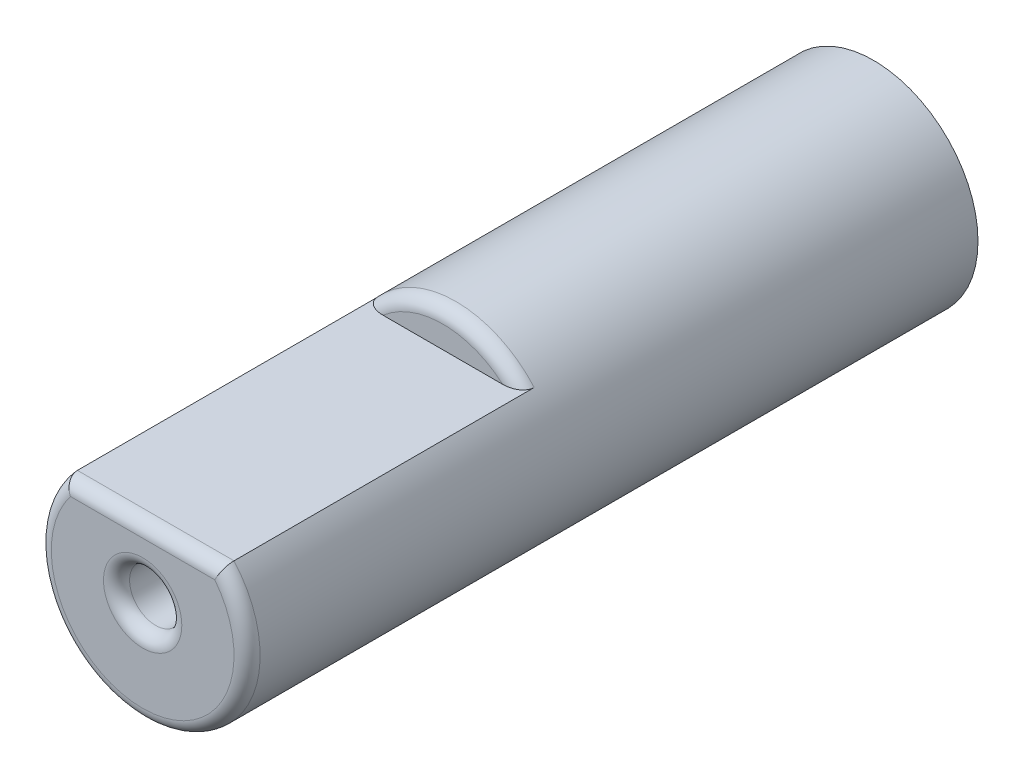
ISO-10303-21;
HEADER;
FILE_DESCRIPTION(('STEP AP214'),'2;1');
FILE_NAME('part.step','',(''),(''),'','','');
FILE_SCHEMA(('AUTOMOTIVE_DESIGN { 1 0 10303 214 1 1 1 1 }'));
ENDSEC;
DATA;
#1=APPLICATION_CONTEXT('core data for automotive mechanical design processes');
#2=APPLICATION_PROTOCOL_DEFINITION('international standard','automotive_design',2000,#1);
#3=PRODUCT_CONTEXT('',#1,'mechanical');
#4=PRODUCT('Part','Part','',(#3));
#5=PRODUCT_RELATED_PRODUCT_CATEGORY('part','',(#4));
#6=PRODUCT_DEFINITION_FORMATION('','',#4);
#7=PRODUCT_DEFINITION_CONTEXT('part definition',#1,'design');
#8=PRODUCT_DEFINITION('design','',#6,#7);
#9=PRODUCT_DEFINITION_SHAPE('','',#8);
#10=(LENGTH_UNIT() NAMED_UNIT(*) SI_UNIT(.MILLI.,.METRE.));
#11=(NAMED_UNIT(*) PLANE_ANGLE_UNIT() SI_UNIT($,.RADIAN.));
#12=(NAMED_UNIT(*) SI_UNIT($,.STERADIAN.) SOLID_ANGLE_UNIT());
#13=UNCERTAINTY_MEASURE_WITH_UNIT(LENGTH_MEASURE(1.E-05),#10,'distance_accuracy_value','');
#14=(GEOMETRIC_REPRESENTATION_CONTEXT(3) GLOBAL_UNCERTAINTY_ASSIGNED_CONTEXT((#13)) GLOBAL_UNIT_ASSIGNED_CONTEXT((#10,
#11,#12)) REPRESENTATION_CONTEXT('',''));
#15=CARTESIAN_POINT('',(0.,0.,0.));
#16=DIRECTION('',(0.,0.,1.));
#17=DIRECTION('',(1.,0.,0.));
#18=AXIS2_PLACEMENT_3D('',#15,#16,#17);
#19=CARTESIAN_POINT('',(0.,0.,28.));
#20=DIRECTION('',(0.,0.,-1.));
#21=DIRECTION('',(-1.,0.,0.));
#22=AXIS2_PLACEMENT_3D('',#19,#20,#21);
#23=CYLINDRICAL_SURFACE('',#22,4.);
#24=DIRECTION('',(0.,0.,1.));
#25=VECTOR('',#24,1.);
#26=CARTESIAN_POINT('',(-3.,2.64575131106459,16.5));
#27=LINE('',#26,#25);
#28=CARTESIAN_POINT('',(-3.,2.64575131106459,16.));
#29=VERTEX_POINT('',#28);
#30=CARTESIAN_POINT('',(-3.,2.64575131106459,27.5));
#31=VERTEX_POINT('',#30);
#32=EDGE_CURVE('E101',#29,#31,#27,.T.);
#33=ORIENTED_EDGE('',*,*,#32,.F.);
#34=CARTESIAN_POINT('',(0.,0.,16.));
#35=DIRECTION('',(0.,0.,1.));
#36=DIRECTION('',(1.,0.,0.));
#37=AXIS2_PLACEMENT_3D('',#34,#35,#36);
#38=CIRCLE('',#37,4.);
#39=CARTESIAN_POINT('',(3.,2.64575131106459,16.));
#40=VERTEX_POINT('',#39);
#41=EDGE_CURVE('E87',#29,#40,#38,.F.);
#42=ORIENTED_EDGE('',*,*,#41,.T.);
#43=DIRECTION('',(0.,0.,1.));
#44=VECTOR('',#43,1.);
#45=CARTESIAN_POINT('',(3.,2.64575131106459,16.5));
#46=LINE('',#45,#44);
#47=CARTESIAN_POINT('',(3.,2.64575131106459,27.5));
#48=VERTEX_POINT('',#47);
#49=EDGE_CURVE('E104',#40,#48,#46,.T.);
#50=ORIENTED_EDGE('',*,*,#49,.T.);
#51=CARTESIAN_POINT('',(0.,0.,27.5));
#52=DIRECTION('',(0.,0.,1.));
#53=DIRECTION('',(1.,0.,0.));
#54=AXIS2_PLACEMENT_3D('',#51,#52,#53);
#55=CIRCLE('',#54,4.);
#56=EDGE_CURVE('E97',#48,#31,#55,.F.);
#57=ORIENTED_EDGE('',*,*,#56,.T.);
#58=EDGE_LOOP('',(#33,#42,#50,#57));
#59=FACE_BOUND('',#58,.T.);
#60=CARTESIAN_POINT('',(0.,0.,0.));
#61=DIRECTION('',(0.,0.,1.));
#62=DIRECTION('',(1.,0.,0.));
#63=AXIS2_PLACEMENT_3D('',#60,#61,#62);
#64=CIRCLE('',#63,4.);
#65=CARTESIAN_POINT('',(4.,0.,0.));
#66=VERTEX_POINT('',#65);
#67=EDGE_CURVE('E98',#66,#66,#64,.T.);
#68=ORIENTED_EDGE('',*,*,#67,.T.);
#69=EDGE_LOOP('',(#68));
#70=FACE_BOUND('',#69,.T.);
#71=ADVANCED_FACE('F34',(#59,#70),#23,.T.);
#72=CARTESIAN_POINT('',(0.,0.,28.));
#73=DIRECTION('',(0.,0.,1.));
#74=DIRECTION('',(1.,0.,0.));
#75=AXIS2_PLACEMENT_3D('',#72,#73,#74);
#76=PLANE('',#75);
#77=CARTESIAN_POINT('',(0.,0.,28.));
#78=DIRECTION('',(0.,0.,1.));
#79=DIRECTION('',(1.,0.,0.));
#80=AXIS2_PLACEMENT_3D('',#77,#78,#79);
#81=CIRCLE('',#80,3.5);
#82=CARTESIAN_POINT('',(-2.76509517215314,2.14575131106459,28.));
#83=VERTEX_POINT('',#82);
#84=CARTESIAN_POINT('',(2.76509517215314,2.14575131106459,28.));
#85=VERTEX_POINT('',#84);
#86=EDGE_CURVE('E55',#83,#85,#81,.T.);
#87=ORIENTED_EDGE('',*,*,#86,.T.);
#88=DIRECTION('',(1.,0.,0.));
#89=VECTOR('',#88,1.);
#90=CARTESIAN_POINT('',(-3.,2.14575131106459,28.));
#91=LINE('',#90,#89);
#92=EDGE_CURVE('E122',#85,#83,#91,.F.);
#93=ORIENTED_EDGE('',*,*,#92,.T.);
#94=EDGE_LOOP('',(#87,#93));
#95=FACE_BOUND('',#94,.T.);
#96=CARTESIAN_POINT('',(0.,0.,28.));
#97=DIRECTION('',(0.,0.,1.));
#98=DIRECTION('',(1.,0.,0.));
#99=AXIS2_PLACEMENT_3D('',#96,#97,#98);
#100=CIRCLE('',#99,1.5);
#101=CARTESIAN_POINT('',(1.5,0.,28.));
#102=VERTEX_POINT('',#101);
#103=EDGE_CURVE('E118',#102,#102,#100,.F.);
#104=ORIENTED_EDGE('',*,*,#103,.T.);
#105=EDGE_LOOP('',(#104));
#106=FACE_BOUND('',#105,.T.);
#107=ADVANCED_FACE('F161',(#95,#106),#76,.T.);
#108=CARTESIAN_POINT('',(0.,0.,0.));
#109=DIRECTION('',(0.,0.,1.));
#110=DIRECTION('',(1.,0.,0.));
#111=AXIS2_PLACEMENT_3D('',#108,#109,#110);
#112=PLANE('',#111);
#113=ORIENTED_EDGE('',*,*,#67,.F.);
#114=EDGE_LOOP('',(#113));
#115=FACE_BOUND('',#114,.T.);
#116=ADVANCED_FACE('F164',(#115),#112,.F.);
#117=CARTESIAN_POINT('',(0.,2.64575131106459,16.5));
#118=DIRECTION('',(0.,-1.,0.));
#119=DIRECTION('',(0.,0.,-1.));
#120=AXIS2_PLACEMENT_3D('',#117,#118,#119);
#121=PLANE('',#120);
#122=ORIENTED_EDGE('',*,*,#32,.T.);
#123=DIRECTION('',(1.,0.,0.));
#124=VECTOR('',#123,1.);
#125=CARTESIAN_POINT('',(3.,2.64575131106459,27.5));
#126=LINE('',#125,#124);
#127=EDGE_CURVE('E115',#31,#48,#126,.T.);
#128=ORIENTED_EDGE('',*,*,#127,.T.);
#129=ORIENTED_EDGE('',*,*,#49,.F.);
#130=CARTESIAN_POINT('',(3.,2.64575131106459,16.));
#131=CARTESIAN_POINT('',(3.00004568685277,2.64575131106459,16.0230193453264));
#132=CARTESIAN_POINT('',(2.99788383820409,2.64575131106459,16.0459961822174));
#133=CARTESIAN_POINT('',(2.98953041582165,2.64575131106459,16.0910479125308));
#134=CARTESIAN_POINT('',(2.98336675862011,2.64575131106459,16.113127936661));
#135=CARTESIAN_POINT('',(2.96740048878864,2.64575131106459,16.1558654444842));
#136=CARTESIAN_POINT('',(2.95760462623021,2.64575131106459,16.1765254831761));
#137=CARTESIAN_POINT('',(2.93490880456858,2.64575131106459,16.2160865364314));
#138=CARTESIAN_POINT('',(2.9220034258787,2.64575131106459,16.2349843990397));
#139=CARTESIAN_POINT('',(2.8890042639193,2.64575131106459,16.2766174559083));
#140=CARTESIAN_POINT('',(2.86794029393532,2.64575131106459,16.2985835896836));
#141=CARTESIAN_POINT('',(2.82253698699825,2.64575131106459,16.3387894061792));
#142=CARTESIAN_POINT('',(2.79819349958651,2.64575131106459,16.357024291859));
#143=CARTESIAN_POINT('',(2.73809689337387,2.64575131106459,16.3957306430875));
#144=CARTESIAN_POINT('',(2.70136920553672,2.64575131106459,16.4146835736586));
#145=CARTESIAN_POINT('',(2.62531330839122,2.64575131106459,16.446536686204));
#146=CARTESIAN_POINT('',(2.58597660154015,2.64575131106459,16.4594158583343));
#147=CARTESIAN_POINT('',(2.50421549540069,2.64575131106459,16.4801588282907));
#148=CARTESIAN_POINT('',(2.46173124773031,2.64575131106459,16.4877795178172));
#149=CARTESIAN_POINT('',(2.3765579949658,2.64575131106459,16.4976629432807));
#150=CARTESIAN_POINT('',(2.3338752229978,2.64575131106459,16.4999781855193));
#151=CARTESIAN_POINT('',(2.29128784747792,2.64575131106459,16.5));
#152=B_SPLINE_CURVE_WITH_KNOTS('',3,(#130,#131,#132,#133,#134,#135,#136,#137,#138,#139,#140,
#141,#142,#143,#144,#145,#146,#147,#148,#149,#150,#151),.UNSPECIFIED.,.F.,.F.,(4,2,2,2,2,2,2,2,
2,2,4),(0.,0.0688894038574242,0.137303326526233,0.205590741191153,0.273998046289219,
0.364799712254438,0.455717392959363,0.579033398001607,0.702772894254838,0.831906529224117,
0.959756546239205),.UNSPECIFIED.);
#153=CARTESIAN_POINT('',(2.29128784747792,2.64575131106459,16.5));
#154=VERTEX_POINT('',#153);
#155=EDGE_CURVE('E11',#40,#154,#152,.T.);
#156=ORIENTED_EDGE('',*,*,#155,.T.);
#157=DIRECTION('',(1.,0.,0.));
#158=VECTOR('',#157,1.);
#159=CARTESIAN_POINT('',(0.,2.64575131106459,16.5));
#160=LINE('',#159,#158);
#161=CARTESIAN_POINT('',(-2.29128784747792,2.64575131106459,16.5));
#162=VERTEX_POINT('',#161);
#163=EDGE_CURVE('E96',#162,#154,#160,.T.);
#164=ORIENTED_EDGE('',*,*,#163,.F.);
#165=CARTESIAN_POINT('',(-2.29128784747792,2.64575131106459,16.5));
#166=CARTESIAN_POINT('',(-2.32027542926785,2.64575131106459,16.499990906309));
#167=CARTESIAN_POINT('',(-2.34924685102549,2.64575131106459,16.4989185116753));
#168=CARTESIAN_POINT('',(-2.40709304909515,2.64575131106459,16.4944506968548));
#169=CARTESIAN_POINT('',(-2.43596729022,2.64575131106459,16.4910484507582));
#170=CARTESIAN_POINT('',(-2.5226833070158,2.64575131106459,16.4769628626549));
#171=CARTESIAN_POINT('',(-2.5800112582815,2.64575131106459,16.462392274396));
#172=CARTESIAN_POINT('',(-2.6676711180261,2.64575131106459,16.4296146392619));
#173=CARTESIAN_POINT('',(-2.69948326943526,2.64575131106459,16.4153097569751));
#174=CARTESIAN_POINT('',(-2.76053619618049,2.64575131106459,16.3821229140917));
#175=CARTESIAN_POINT('',(-2.7897866612078,2.64575131106459,16.3632593149953));
#176=CARTESIAN_POINT('',(-2.83925214677981,2.64575131106459,16.3248005357676));
#177=CARTESIAN_POINT('',(-2.86012118663257,2.64575131106459,16.3060501622912));
#178=CARTESIAN_POINT('',(-2.89856329584846,2.64575131106459,16.2653919732916));
#179=CARTESIAN_POINT('',(-2.91613818082262,2.64575131106459,16.2434859089088));
#180=CARTESIAN_POINT('',(-2.94428222459036,2.64575131106459,16.2008837151381));
#181=CARTESIAN_POINT('',(-2.95553858827425,2.64575131106459,16.1806425069503));
#182=CARTESIAN_POINT('',(-2.97452111375817,2.64575131106459,16.1385811403188));
#183=CARTESIAN_POINT('',(-2.98225366901745,2.64575131106459,16.1167639253481));
#184=CARTESIAN_POINT('',(-2.99194513624933,2.64575131106459,16.0790451107208));
#185=CARTESIAN_POINT('',(-2.9949508569341,2.64575131106459,16.0634069101697));
#186=CARTESIAN_POINT('',(-2.99898472258871,2.64575131106459,16.0318503707097));
#187=CARTESIAN_POINT('',(-3.00000935529483,2.64575131106459,16.015931584662));
#188=CARTESIAN_POINT('',(-3.,2.64575131106459,16.));
#189=B_SPLINE_CURVE_WITH_KNOTS('',3,(#165,#166,#167,#168,#169,#170,#171,#172,#173,#174,#175,
#176,#177,#178,#179,#180,#181,#182,#183,#184,#185,#186,#187,#188),.UNSPECIFIED.,.F.,.F.,(4,2,2,
2,2,2,2,2,2,2,2,4),(0.,0.0869027539412975,0.174061207685939,0.350179329011076,0.45452056851652,
0.558448350954514,0.642305606668924,0.726116506710771,0.795315308530403,0.864388053951729,
0.912042754495017,0.959781864692281),.UNSPECIFIED.);
#190=EDGE_CURVE('E48',#162,#29,#189,.T.);
#191=ORIENTED_EDGE('',*,*,#190,.T.);
#192=EDGE_LOOP('',(#122,#128,#129,#156,#164,#191));
#193=FACE_BOUND('',#192,.T.);
#194=ADVANCED_FACE('F100',(#193),#121,.F.);
#195=CARTESIAN_POINT('',(0.,-8.94142135623731,16.5));
#196=DIRECTION('',(0.,0.,1.));
#197=DIRECTION('',(1.,0.,0.));
#198=AXIS2_PLACEMENT_3D('',#195,#196,#197);
#199=PLANE('',#198);
#200=ORIENTED_EDGE('',*,*,#163,.T.);
#201=CARTESIAN_POINT('',(0.,0.,16.5));
#202=DIRECTION('',(0.,0.,1.));
#203=DIRECTION('',(1.,0.,0.));
#204=AXIS2_PLACEMENT_3D('',#201,#202,#203);
#205=CIRCLE('',#204,3.5);
#206=EDGE_CURVE('E85',#154,#162,#205,.T.);
#207=ORIENTED_EDGE('',*,*,#206,.T.);
#208=EDGE_LOOP('',(#200,#207));
#209=FACE_BOUND('',#208,.T.);
#210=ADVANCED_FACE('F95',(#209),#199,.T.);
#211=CARTESIAN_POINT('',(0.,0.,24.));
#212=DIRECTION('',(0.,0.,1.));
#213=DIRECTION('',(1.,0.,0.));
#214=AXIS2_PLACEMENT_3D('',#211,#212,#213);
#215=CYLINDRICAL_SURFACE('',#214,1.);
#216=CARTESIAN_POINT('',(0.,0.,27.5));
#217=DIRECTION('',(0.,0.,1.));
#218=DIRECTION('',(1.,0.,0.));
#219=AXIS2_PLACEMENT_3D('',#216,#217,#218);
#220=CIRCLE('',#219,1.);
#221=CARTESIAN_POINT('',(1.,0.,27.5));
#222=VERTEX_POINT('',#221);
#223=EDGE_CURVE('E91',#222,#222,#220,.T.);
#224=ORIENTED_EDGE('',*,*,#223,.T.);
#225=EDGE_LOOP('',(#224));
#226=FACE_BOUND('',#225,.T.);
#227=CARTESIAN_POINT('',(0.,0.,24.));
#228=DIRECTION('',(0.,0.,1.));
#229=DIRECTION('',(1.,0.,0.));
#230=AXIS2_PLACEMENT_3D('',#227,#228,#229);
#231=CIRCLE('',#230,1.);
#232=CARTESIAN_POINT('',(1.,0.,24.));
#233=VERTEX_POINT('',#232);
#234=EDGE_CURVE('E102',#233,#233,#231,.T.);
#235=ORIENTED_EDGE('',*,*,#234,.F.);
#236=EDGE_LOOP('',(#235));
#237=FACE_BOUND('',#236,.T.);
#238=ADVANCED_FACE('F179',(#226,#237),#215,.F.);
#239=CARTESIAN_POINT('',(0.,0.,24.));
#240=DIRECTION('',(0.,0.,1.));
#241=DIRECTION('',(1.,0.,0.));
#242=AXIS2_PLACEMENT_3D('',#239,#240,#241);
#243=PLANE('',#242);
#244=ORIENTED_EDGE('',*,*,#234,.T.);
#245=EDGE_LOOP('',(#244));
#246=FACE_BOUND('',#245,.T.);
#247=ADVANCED_FACE('F142',(#246),#243,.T.);
#248=CARTESIAN_POINT('',(0.,0.,16.));
#249=DIRECTION('',(0.,0.,1.));
#250=DIRECTION('',(1.,0.,0.));
#251=AXIS2_PLACEMENT_3D('',#248,#249,#250);
#252=TOROIDAL_SURFACE('',#251,3.5,0.5);
#253=ORIENTED_EDGE('',*,*,#155,.F.);
#254=ORIENTED_EDGE('',*,*,#41,.F.);
#255=ORIENTED_EDGE('',*,*,#190,.F.);
#256=ORIENTED_EDGE('',*,*,#206,.F.);
#257=EDGE_LOOP('',(#253,#254,#255,#256));
#258=FACE_BOUND('',#257,.T.);
#259=ADVANCED_FACE('F84',(#258),#252,.T.);
#260=CARTESIAN_POINT('',(0.,0.,27.5));
#261=DIRECTION('',(0.,0.,1.));
#262=DIRECTION('',(1.,0.,0.));
#263=AXIS2_PLACEMENT_3D('',#260,#261,#262);
#264=TOROIDAL_SURFACE('',#263,3.5,0.5);
#265=CARTESIAN_POINT('',(3.,2.64575131106459,27.5));
#266=CARTESIAN_POINT('',(3.00001219471238,2.64578209668731,27.526307710617));
#267=CARTESIAN_POINT('',(2.99906368409333,2.64367716519129,27.5525947759823));
#268=CARTESIAN_POINT('',(2.99534180470378,2.63543798935714,27.6043177598811));
#269=CARTESIAN_POINT('',(2.99257399603744,2.62931602190649,27.6297560243899));
#270=CARTESIAN_POINT('',(2.98531028135025,2.61328502680343,27.6791319509262));
#271=CARTESIAN_POINT('',(2.98081497241779,2.60337730765443,27.7030701281184));
#272=CARTESIAN_POINT('',(2.97025431179441,2.58017350620825,27.7488701595425));
#273=CARTESIAN_POINT('',(2.96418827284477,2.56687594075406,27.7707310991602));
#274=CARTESIAN_POINT('',(2.9504424928465,2.5368578184032,27.8126052924554));
#275=CARTESIAN_POINT('',(2.94271461121359,2.52003564990795,27.8325296545674));
#276=CARTESIAN_POINT('',(2.92600575220936,2.48383123206609,27.8692802638563));
#277=CARTESIAN_POINT('',(2.91702440070827,2.464448218463,27.8861055825542));
#278=CARTESIAN_POINT('',(2.8972395654976,2.42197091423909,27.9176847309929));
#279=CARTESIAN_POINT('',(2.88634645575697,2.39870173121719,27.9321467788199));
#280=CARTESIAN_POINT('',(2.86363234724003,2.35048104431037,27.95697013005));
#281=CARTESIAN_POINT('',(2.85181082450894,2.32552859159996,27.9673290976388));
#282=CARTESIAN_POINT('',(2.82804016649552,2.27568483006556,27.9835023762097));
#283=CARTESIAN_POINT('',(2.81611830501175,2.25083689881814,27.9894927250805));
#284=CARTESIAN_POINT('',(2.79191914707345,2.20073211756874,27.9976135279648));
#285=CARTESIAN_POINT('',(2.77964259471384,2.17547616657246,27.9997515400344));
#286=CARTESIAN_POINT('',(2.76657027270946,2.14876375888549,27.999993208048));
#287=CARTESIAN_POINT('',(2.76583281303941,2.14725741584632,28.0000000146165));
#288=CARTESIAN_POINT('',(2.76509517215314,2.14575131106459,28.));
#289=B_SPLINE_CURVE_WITH_KNOTS('',3,(#265,#266,#267,#268,#269,#270,#271,#272,#273,#274,#275,
#276,#277,#278,#279,#280,#281,#282,#283,#284,#285,#286,#287,#288),.UNSPECIFIED.,.F.,.F.,(4,2,2,
2,2,2,2,2,2,2,2,4),(0.,0.0787899097684037,0.15734013596701,0.235863236667939,0.314420752668102,
0.395668019840544,0.476939589384055,0.565022320368353,0.653155123539344,0.737503729593137,
0.821686667749364,0.826718168717919),.UNSPECIFIED.);
#290=EDGE_CURVE('E151',#85,#48,#289,.F.);
#291=ORIENTED_EDGE('',*,*,#290,.F.);
#292=ORIENTED_EDGE('',*,*,#86,.F.);
#293=CARTESIAN_POINT('',(-3.,2.64575131106459,27.5));
#294=CARTESIAN_POINT('',(-3.00001219471238,2.64578209668731,27.526307710617));
#295=CARTESIAN_POINT('',(-2.99906368409333,2.64367716519129,27.5525947759823));
#296=CARTESIAN_POINT('',(-2.99534180470378,2.63543798935714,27.6043177598811));
#297=CARTESIAN_POINT('',(-2.99257399603744,2.62931602190649,27.6297560243899));
#298=CARTESIAN_POINT('',(-2.98531028135025,2.61328502680343,27.6791319509262));
#299=CARTESIAN_POINT('',(-2.98081497241779,2.60337730765443,27.7030701281184));
#300=CARTESIAN_POINT('',(-2.97025431179441,2.58017350620825,27.7488701595425));
#301=CARTESIAN_POINT('',(-2.96418827284477,2.56687594075406,27.7707310991602));
#302=CARTESIAN_POINT('',(-2.9504424928465,2.5368578184032,27.8126052924554));
#303=CARTESIAN_POINT('',(-2.94271461121359,2.52003564990795,27.8325296545674));
#304=CARTESIAN_POINT('',(-2.92600575220936,2.48383123206609,27.8692802638563));
#305=CARTESIAN_POINT('',(-2.91702440070827,2.464448218463,27.8861055825542));
#306=CARTESIAN_POINT('',(-2.8972395654976,2.42197091423909,27.9176847309929));
#307=CARTESIAN_POINT('',(-2.88634645575697,2.39870173121719,27.9321467788199));
#308=CARTESIAN_POINT('',(-2.86363234724003,2.35048104431037,27.95697013005));
#309=CARTESIAN_POINT('',(-2.85181082450894,2.32552859159996,27.9673290976388));
#310=CARTESIAN_POINT('',(-2.82804016649552,2.27568483006556,27.9835023762097));
#311=CARTESIAN_POINT('',(-2.81611830501175,2.25083689881814,27.9894927250805));
#312=CARTESIAN_POINT('',(-2.79191914707345,2.20073211756874,27.9976135279648));
#313=CARTESIAN_POINT('',(-2.77964259471384,2.17547616657246,27.9997515400344));
#314=CARTESIAN_POINT('',(-2.76657027270946,2.14876375888549,27.999993208048));
#315=CARTESIAN_POINT('',(-2.76583281303941,2.14725741584632,28.0000000146165));
#316=CARTESIAN_POINT('',(-2.76509517215314,2.14575131106459,28.));
#317=B_SPLINE_CURVE_WITH_KNOTS('',3,(#293,#294,#295,#296,#297,#298,#299,#300,#301,#302,#303,
#304,#305,#306,#307,#308,#309,#310,#311,#312,#313,#314,#315,#316),.UNSPECIFIED.,.F.,.F.,(4,2,2,
2,2,2,2,2,2,2,2,4),(0.,0.0787899097684037,0.15734013596701,0.235863236667939,0.314420752668102,
0.395668019840544,0.476939589384055,0.565022320368353,0.653155123539344,0.737503729593137,
0.821686667749364,0.826718168717919),.UNSPECIFIED.);
#318=EDGE_CURVE('E38',#31,#83,#317,.T.);
#319=ORIENTED_EDGE('',*,*,#318,.F.);
#320=ORIENTED_EDGE('',*,*,#56,.F.);
#321=EDGE_LOOP('',(#291,#292,#319,#320));
#322=FACE_BOUND('',#321,.T.);
#323=ADVANCED_FACE('F141',(#322),#264,.T.);
#324=CARTESIAN_POINT('',(0.,2.14575131106459,27.5));
#325=DIRECTION('',(-1.,0.,0.));
#326=DIRECTION('',(0.,0.,1.));
#327=AXIS2_PLACEMENT_3D('',#324,#325,#326);
#328=CYLINDRICAL_SURFACE('',#327,0.5);
#329=ORIENTED_EDGE('',*,*,#318,.T.);
#330=ORIENTED_EDGE('',*,*,#92,.F.);
#331=ORIENTED_EDGE('',*,*,#290,.T.);
#332=ORIENTED_EDGE('',*,*,#127,.F.);
#333=EDGE_LOOP('',(#329,#330,#331,#332));
#334=FACE_BOUND('',#333,.T.);
#335=ADVANCED_FACE('F147',(#334),#328,.T.);
#336=CARTESIAN_POINT('',(0.,0.,27.5));
#337=DIRECTION('',(0.,0.,1.));
#338=DIRECTION('',(1.,0.,0.));
#339=AXIS2_PLACEMENT_3D('',#336,#337,#338);
#340=TOROIDAL_SURFACE('',#339,1.5,0.5);
#341=ORIENTED_EDGE('',*,*,#103,.F.);
#342=EDGE_LOOP('',(#341));
#343=FACE_BOUND('',#342,.T.);
#344=ORIENTED_EDGE('',*,*,#223,.F.);
#345=EDGE_LOOP('',(#344));
#346=FACE_BOUND('',#345,.T.);
#347=ADVANCED_FACE('F36',(#343,#346),#340,.T.);
#348=CLOSED_SHELL('',(#71,#107,#116,#194,#210,#238,#247,#259,#323,#335,#347));
#349=MANIFOLD_SOLID_BREP('B2',#348);
#350=ADVANCED_BREP_SHAPE_REPRESENTATION('',(#18,#349),#14);
#351=SHAPE_DEFINITION_REPRESENTATION(#9,#350);
ENDSEC;
END-ISO-10303-21;
